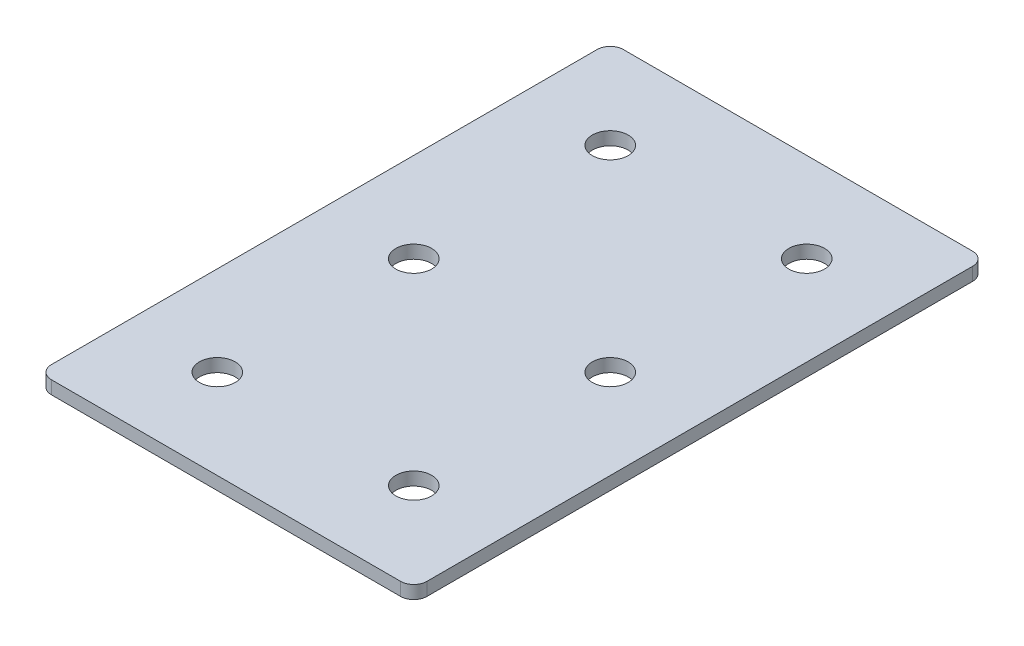
ISO-10303-21;
HEADER;
FILE_DESCRIPTION(('STEP AP214'),'2;1');
FILE_NAME('part.step','',(''),(''),'','','');
FILE_SCHEMA(('AUTOMOTIVE_DESIGN { 1 0 10303 214 1 1 1 1 }'));
ENDSEC;
DATA;
#1=APPLICATION_CONTEXT('core data for automotive mechanical design processes');
#2=APPLICATION_PROTOCOL_DEFINITION('international standard','automotive_design',2000,#1);
#3=PRODUCT_CONTEXT('',#1,'mechanical');
#4=PRODUCT('Part','Part','',(#3));
#5=PRODUCT_RELATED_PRODUCT_CATEGORY('part','',(#4));
#6=PRODUCT_DEFINITION_FORMATION('','',#4);
#7=PRODUCT_DEFINITION_CONTEXT('part definition',#1,'design');
#8=PRODUCT_DEFINITION('design','',#6,#7);
#9=PRODUCT_DEFINITION_SHAPE('','',#8);
#10=(LENGTH_UNIT() NAMED_UNIT(*) SI_UNIT(.MILLI.,.METRE.));
#11=(NAMED_UNIT(*) PLANE_ANGLE_UNIT() SI_UNIT($,.RADIAN.));
#12=(NAMED_UNIT(*) SI_UNIT($,.STERADIAN.) SOLID_ANGLE_UNIT());
#13=UNCERTAINTY_MEASURE_WITH_UNIT(LENGTH_MEASURE(1.E-05),#10,'distance_accuracy_value','');
#14=(GEOMETRIC_REPRESENTATION_CONTEXT(3) GLOBAL_UNCERTAINTY_ASSIGNED_CONTEXT((#13)) GLOBAL_UNIT_ASSIGNED_CONTEXT((#10,
#11,#12)) REPRESENTATION_CONTEXT('',''));
#15=CARTESIAN_POINT('',(0.,0.,0.));
#16=DIRECTION('',(0.,0.,1.));
#17=DIRECTION('',(1.,0.,0.));
#18=AXIS2_PLACEMENT_3D('',#15,#16,#17);
#19=CARTESIAN_POINT('',(-1.74941930794148,1.42462627726309,-46.174731674098));
#20=DIRECTION('',(0.,-1.,0.));
#21=DIRECTION('',(0.,0.,-1.));
#22=AXIS2_PLACEMENT_3D('',#19,#20,#21);
#23=PLANE('',#22);
#24=CARTESIAN_POINT('',(20.7505806920585,1.42462627726309,43.825268325902));
#25=DIRECTION('',(0.,1.,0.));
#26=DIRECTION('',(0.,0.,1.));
#27=AXIS2_PLACEMENT_3D('',#24,#25,#26);
#28=CIRCLE('',#27,4.1);
#29=CARTESIAN_POINT('',(20.7505806920585,1.42462627726309,47.925268325902));
#30=VERTEX_POINT('',#29);
#31=EDGE_CURVE('E177',#30,#30,#28,.T.);
#32=ORIENTED_EDGE('',*,*,#31,.T.);
#33=EDGE_LOOP('',(#32));
#34=FACE_BOUND('',#33,.T.);
#35=CARTESIAN_POINT('',(-24.2494193079415,1.42462627726309,43.825268325902));
#36=DIRECTION('',(0.,1.,0.));
#37=DIRECTION('',(0.,0.,1.));
#38=AXIS2_PLACEMENT_3D('',#35,#36,#37);
#39=CIRCLE('',#38,4.1);
#40=CARTESIAN_POINT('',(-24.2494193079415,1.42462627726309,47.925268325902));
#41=VERTEX_POINT('',#40);
#42=EDGE_CURVE('E171',#41,#41,#39,.T.);
#43=ORIENTED_EDGE('',*,*,#42,.T.);
#44=EDGE_LOOP('',(#43));
#45=FACE_BOUND('',#44,.T.);
#46=CARTESIAN_POINT('',(20.7505806920585,1.42462627726309,-1.17473167409795));
#47=DIRECTION('',(0.,1.,0.));
#48=DIRECTION('',(0.,0.,1.));
#49=AXIS2_PLACEMENT_3D('',#46,#47,#48);
#50=CIRCLE('',#49,4.1);
#51=CARTESIAN_POINT('',(20.7505806920585,1.42462627726309,2.92526832590205));
#52=VERTEX_POINT('',#51);
#53=EDGE_CURVE('E165',#52,#52,#50,.T.);
#54=ORIENTED_EDGE('',*,*,#53,.T.);
#55=EDGE_LOOP('',(#54));
#56=FACE_BOUND('',#55,.T.);
#57=CARTESIAN_POINT('',(-24.2494193079415,1.42462627726309,-1.17473167409795));
#58=DIRECTION('',(0.,1.,0.));
#59=DIRECTION('',(0.,0.,1.));
#60=AXIS2_PLACEMENT_3D('',#57,#58,#59);
#61=CIRCLE('',#60,4.1);
#62=CARTESIAN_POINT('',(-24.2494193079415,1.42462627726309,2.92526832590205));
#63=VERTEX_POINT('',#62);
#64=EDGE_CURVE('E159',#63,#63,#61,.T.);
#65=ORIENTED_EDGE('',*,*,#64,.T.);
#66=EDGE_LOOP('',(#65));
#67=FACE_BOUND('',#66,.T.);
#68=CARTESIAN_POINT('',(20.7505806920585,1.42462627726309,-46.174731674098));
#69=DIRECTION('',(0.,1.,0.));
#70=DIRECTION('',(0.,0.,1.));
#71=AXIS2_PLACEMENT_3D('',#68,#69,#70);
#72=CIRCLE('',#71,4.1);
#73=CARTESIAN_POINT('',(20.7505806920585,1.42462627726309,-42.074731674098));
#74=VERTEX_POINT('',#73);
#75=EDGE_CURVE('E154',#74,#74,#72,.T.);
#76=ORIENTED_EDGE('',*,*,#75,.T.);
#77=EDGE_LOOP('',(#76));
#78=FACE_BOUND('',#77,.T.);
#79=CARTESIAN_POINT('',(-24.2494193079415,1.42462627726309,-46.174731674098));
#80=DIRECTION('',(0.,1.,0.));
#81=DIRECTION('',(0.,0.,1.));
#82=AXIS2_PLACEMENT_3D('',#79,#80,#81);
#83=CIRCLE('',#82,4.1);
#84=CARTESIAN_POINT('',(-24.2494193079415,1.42462627726309,-42.074731674098));
#85=VERTEX_POINT('',#84);
#86=EDGE_CURVE('E147',#85,#85,#83,.T.);
#87=ORIENTED_EDGE('',*,*,#86,.T.);
#88=EDGE_LOOP('',(#87));
#89=FACE_BOUND('',#88,.T.);
#90=DIRECTION('',(0.,0.,-1.));
#91=VECTOR('',#90,1.);
#92=CARTESIAN_POINT('',(41.2505806920586,1.42462627726309,64.325268325902));
#93=LINE('',#92,#91);
#94=CARTESIAN_POINT('',(41.2505806920586,1.42462627726309,61.325268325902));
#95=VERTEX_POINT('',#94);
#96=CARTESIAN_POINT('',(41.2505806920586,1.42462627726309,-63.674731674098));
#97=VERTEX_POINT('',#96);
#98=EDGE_CURVE('E106',#95,#97,#93,.T.);
#99=ORIENTED_EDGE('',*,*,#98,.F.);
#100=CARTESIAN_POINT('',(38.2505806920586,1.42462627726309,61.325268325902));
#101=DIRECTION('',(0.,-1.,0.));
#102=DIRECTION('',(0.,0.,-1.));
#103=AXIS2_PLACEMENT_3D('',#100,#101,#102);
#104=CIRCLE('',#103,3.);
#105=CARTESIAN_POINT('',(38.2505806920586,1.42462627726309,64.325268325902));
#106=VERTEX_POINT('',#105);
#107=EDGE_CURVE('E128',#95,#106,#104,.T.);
#108=ORIENTED_EDGE('',*,*,#107,.T.);
#109=DIRECTION('',(1.,0.,0.));
#110=VECTOR('',#109,1.);
#111=CARTESIAN_POINT('',(-44.7494193079416,1.42462627726309,64.325268325902));
#112=LINE('',#111,#110);
#113=CARTESIAN_POINT('',(-41.7494193079416,1.42462627726309,64.325268325902));
#114=VERTEX_POINT('',#113);
#115=EDGE_CURVE('E110',#114,#106,#112,.T.);
#116=ORIENTED_EDGE('',*,*,#115,.F.);
#117=CARTESIAN_POINT('',(-41.7494193079416,1.42462627726309,61.325268325902));
#118=DIRECTION('',(0.,-1.,0.));
#119=DIRECTION('',(0.,0.,-1.));
#120=AXIS2_PLACEMENT_3D('',#117,#118,#119);
#121=CIRCLE('',#120,3.);
#122=CARTESIAN_POINT('',(-44.7494193079416,1.42462627726309,61.325268325902));
#123=VERTEX_POINT('',#122);
#124=EDGE_CURVE('E105',#114,#123,#121,.T.);
#125=ORIENTED_EDGE('',*,*,#124,.T.);
#126=DIRECTION('',(0.,0.,1.));
#127=VECTOR('',#126,1.);
#128=CARTESIAN_POINT('',(-44.7494193079416,1.42462627726309,-66.674731674098));
#129=LINE('',#128,#127);
#130=CARTESIAN_POINT('',(-44.7494193079416,1.42462627726309,-63.674731674098));
#131=VERTEX_POINT('',#130);
#132=EDGE_CURVE('E137',#131,#123,#129,.T.);
#133=ORIENTED_EDGE('',*,*,#132,.F.);
#134=CARTESIAN_POINT('',(-41.7494193079416,1.42462627726309,-63.674731674098));
#135=DIRECTION('',(0.,-1.,0.));
#136=DIRECTION('',(0.,0.,-1.));
#137=AXIS2_PLACEMENT_3D('',#134,#135,#136);
#138=CIRCLE('',#137,3.);
#139=CARTESIAN_POINT('',(-41.7494193079416,1.42462627726309,-66.674731674098));
#140=VERTEX_POINT('',#139);
#141=EDGE_CURVE('E31',#131,#140,#138,.T.);
#142=ORIENTED_EDGE('',*,*,#141,.T.);
#143=DIRECTION('',(-1.,0.,0.));
#144=VECTOR('',#143,1.);
#145=CARTESIAN_POINT('',(41.2505806920586,1.42462627726309,-66.674731674098));
#146=LINE('',#145,#144);
#147=CARTESIAN_POINT('',(38.2505806920586,1.42462627726309,-66.674731674098));
#148=VERTEX_POINT('',#147);
#149=EDGE_CURVE('E138',#148,#140,#146,.T.);
#150=ORIENTED_EDGE('',*,*,#149,.F.);
#151=CARTESIAN_POINT('',(38.2505806920586,1.42462627726309,-63.674731674098));
#152=DIRECTION('',(0.,-1.,0.));
#153=DIRECTION('',(0.,0.,-1.));
#154=AXIS2_PLACEMENT_3D('',#151,#152,#153);
#155=CIRCLE('',#154,3.);
#156=EDGE_CURVE('E126',#148,#97,#155,.T.);
#157=ORIENTED_EDGE('',*,*,#156,.T.);
#158=EDGE_LOOP('',(#99,#108,#116,#125,#133,#142,#150,#157));
#159=FACE_BOUND('',#158,.T.);
#160=ADVANCED_FACE('F16',(#34,#45,#56,#67,#78,#89,#159),#23,.T.);
#161=CARTESIAN_POINT('',(41.2505806920586,1.42462627726309,-66.674731674098));
#162=DIRECTION('',(0.,0.,-1.));
#163=DIRECTION('',(-1.,0.,0.));
#164=AXIS2_PLACEMENT_3D('',#161,#162,#163);
#165=PLANE('',#164);
#166=DIRECTION('',(-1.,0.,0.));
#167=VECTOR('',#166,1.);
#168=CARTESIAN_POINT('',(41.2505806920586,4.42462627726309,-66.674731674098));
#169=LINE('',#168,#167);
#170=CARTESIAN_POINT('',(38.2505806920586,4.42462627726309,-66.674731674098));
#171=VERTEX_POINT('',#170);
#172=CARTESIAN_POINT('',(-41.7494193079416,4.42462627726309,-66.674731674098));
#173=VERTEX_POINT('',#172);
#174=EDGE_CURVE('E144',#171,#173,#169,.T.);
#175=ORIENTED_EDGE('',*,*,#174,.F.);
#176=DIRECTION('',(0.,1.,0.));
#177=VECTOR('',#176,1.);
#178=CARTESIAN_POINT('',(38.2505806920586,1.42462627726309,-66.674731674098));
#179=LINE('',#178,#177);
#180=EDGE_CURVE('E38',#171,#148,#179,.F.);
#181=ORIENTED_EDGE('',*,*,#180,.T.);
#182=ORIENTED_EDGE('',*,*,#149,.T.);
#183=DIRECTION('',(0.,1.,0.));
#184=VECTOR('',#183,1.);
#185=CARTESIAN_POINT('',(-41.7494193079416,1.42462627726309,-66.674731674098));
#186=LINE('',#185,#184);
#187=EDGE_CURVE('E130',#140,#173,#186,.T.);
#188=ORIENTED_EDGE('',*,*,#187,.T.);
#189=EDGE_LOOP('',(#175,#181,#182,#188));
#190=FACE_BOUND('',#189,.T.);
#191=ADVANCED_FACE('F223',(#190),#165,.T.);
#192=CARTESIAN_POINT('',(41.2505806920586,1.42462627726309,64.325268325902));
#193=DIRECTION('',(1.,0.,0.));
#194=DIRECTION('',(0.,0.,-1.));
#195=AXIS2_PLACEMENT_3D('',#192,#193,#194);
#196=PLANE('',#195);
#197=DIRECTION('',(0.,0.,-1.));
#198=VECTOR('',#197,1.);
#199=CARTESIAN_POINT('',(41.2505806920586,4.42462627726309,64.325268325902));
#200=LINE('',#199,#198);
#201=CARTESIAN_POINT('',(41.2505806920586,4.42462627726309,61.325268325902));
#202=VERTEX_POINT('',#201);
#203=CARTESIAN_POINT('',(41.2505806920586,4.42462627726309,-63.674731674098));
#204=VERTEX_POINT('',#203);
#205=EDGE_CURVE('E102',#202,#204,#200,.T.);
#206=ORIENTED_EDGE('',*,*,#205,.F.);
#207=DIRECTION('',(0.,1.,0.));
#208=VECTOR('',#207,1.);
#209=CARTESIAN_POINT('',(41.2505806920586,1.42462627726309,61.325268325902));
#210=LINE('',#209,#208);
#211=EDGE_CURVE('E122',#202,#95,#210,.F.);
#212=ORIENTED_EDGE('',*,*,#211,.T.);
#213=ORIENTED_EDGE('',*,*,#98,.T.);
#214=DIRECTION('',(0.,1.,0.));
#215=VECTOR('',#214,1.);
#216=CARTESIAN_POINT('',(41.2505806920586,1.42462627726309,-63.674731674098));
#217=LINE('',#216,#215);
#218=EDGE_CURVE('E119',#97,#204,#217,.T.);
#219=ORIENTED_EDGE('',*,*,#218,.T.);
#220=EDGE_LOOP('',(#206,#212,#213,#219));
#221=FACE_BOUND('',#220,.T.);
#222=ADVANCED_FACE('F228',(#221),#196,.T.);
#223=CARTESIAN_POINT('',(-44.7494193079416,1.42462627726309,64.325268325902));
#224=DIRECTION('',(0.,0.,1.));
#225=DIRECTION('',(1.,0.,0.));
#226=AXIS2_PLACEMENT_3D('',#223,#224,#225);
#227=PLANE('',#226);
#228=ORIENTED_EDGE('',*,*,#115,.T.);
#229=DIRECTION('',(0.,1.,0.));
#230=VECTOR('',#229,1.);
#231=CARTESIAN_POINT('',(38.2505806920586,1.42462627726309,64.325268325902));
#232=LINE('',#231,#230);
#233=CARTESIAN_POINT('',(38.2505806920586,4.42462627726309,64.325268325902));
#234=VERTEX_POINT('',#233);
#235=EDGE_CURVE('E93',#106,#234,#232,.T.);
#236=ORIENTED_EDGE('',*,*,#235,.T.);
#237=DIRECTION('',(1.,0.,0.));
#238=VECTOR('',#237,1.);
#239=CARTESIAN_POINT('',(-44.7494193079416,4.42462627726309,64.325268325902));
#240=LINE('',#239,#238);
#241=CARTESIAN_POINT('',(-41.7494193079416,4.42462627726309,64.325268325902));
#242=VERTEX_POINT('',#241);
#243=EDGE_CURVE('E85',#242,#234,#240,.T.);
#244=ORIENTED_EDGE('',*,*,#243,.F.);
#245=DIRECTION('',(0.,1.,0.));
#246=VECTOR('',#245,1.);
#247=CARTESIAN_POINT('',(-41.7494193079416,1.42462627726309,64.325268325902));
#248=LINE('',#247,#246);
#249=EDGE_CURVE('E99',#242,#114,#248,.F.);
#250=ORIENTED_EDGE('',*,*,#249,.T.);
#251=EDGE_LOOP('',(#228,#236,#244,#250));
#252=FACE_BOUND('',#251,.T.);
#253=ADVANCED_FACE('F98',(#252),#227,.T.);
#254=CARTESIAN_POINT('',(-44.7494193079416,1.42462627726309,-66.674731674098));
#255=DIRECTION('',(-1.,0.,0.));
#256=DIRECTION('',(0.,0.,1.));
#257=AXIS2_PLACEMENT_3D('',#254,#255,#256);
#258=PLANE('',#257);
#259=DIRECTION('',(0.,0.,1.));
#260=VECTOR('',#259,1.);
#261=CARTESIAN_POINT('',(-44.7494193079416,4.42462627726309,-66.674731674098));
#262=LINE('',#261,#260);
#263=CARTESIAN_POINT('',(-44.7494193079416,4.42462627726309,-63.674731674098));
#264=VERTEX_POINT('',#263);
#265=CARTESIAN_POINT('',(-44.7494193079416,4.42462627726309,61.325268325902));
#266=VERTEX_POINT('',#265);
#267=EDGE_CURVE('E87',#264,#266,#262,.T.);
#268=ORIENTED_EDGE('',*,*,#267,.F.);
#269=DIRECTION('',(0.,1.,0.));
#270=VECTOR('',#269,1.);
#271=CARTESIAN_POINT('',(-44.7494193079416,1.42462627726309,-63.674731674098));
#272=LINE('',#271,#270);
#273=EDGE_CURVE('E10',#264,#131,#272,.F.);
#274=ORIENTED_EDGE('',*,*,#273,.T.);
#275=ORIENTED_EDGE('',*,*,#132,.T.);
#276=DIRECTION('',(0.,1.,0.));
#277=VECTOR('',#276,1.);
#278=CARTESIAN_POINT('',(-44.7494193079416,1.42462627726309,61.325268325902));
#279=LINE('',#278,#277);
#280=EDGE_CURVE('E24',#123,#266,#279,.T.);
#281=ORIENTED_EDGE('',*,*,#280,.T.);
#282=EDGE_LOOP('',(#268,#274,#275,#281));
#283=FACE_BOUND('',#282,.T.);
#284=ADVANCED_FACE('F135',(#283),#258,.T.);
#285=CARTESIAN_POINT('',(-1.74941930794148,4.42462627726309,-46.174731674098));
#286=DIRECTION('',(0.,-1.,0.));
#287=DIRECTION('',(0.,0.,-1.));
#288=AXIS2_PLACEMENT_3D('',#285,#286,#287);
#289=PLANE('',#288);
#290=CARTESIAN_POINT('',(20.7505806920585,4.42462627726309,43.825268325902));
#291=DIRECTION('',(0.,1.,0.));
#292=DIRECTION('',(0.,0.,1.));
#293=AXIS2_PLACEMENT_3D('',#290,#291,#292);
#294=CIRCLE('',#293,4.1);
#295=CARTESIAN_POINT('',(20.7505806920585,4.42462627726309,47.925268325902));
#296=VERTEX_POINT('',#295);
#297=EDGE_CURVE('E180',#296,#296,#294,.T.);
#298=ORIENTED_EDGE('',*,*,#297,.F.);
#299=EDGE_LOOP('',(#298));
#300=FACE_BOUND('',#299,.T.);
#301=CARTESIAN_POINT('',(-24.2494193079415,4.42462627726309,43.825268325902));
#302=DIRECTION('',(0.,1.,0.));
#303=DIRECTION('',(0.,0.,1.));
#304=AXIS2_PLACEMENT_3D('',#301,#302,#303);
#305=CIRCLE('',#304,4.1);
#306=CARTESIAN_POINT('',(-24.2494193079415,4.42462627726309,47.925268325902));
#307=VERTEX_POINT('',#306);
#308=EDGE_CURVE('E174',#307,#307,#305,.T.);
#309=ORIENTED_EDGE('',*,*,#308,.F.);
#310=EDGE_LOOP('',(#309));
#311=FACE_BOUND('',#310,.T.);
#312=CARTESIAN_POINT('',(20.7505806920585,4.42462627726309,-1.17473167409795));
#313=DIRECTION('',(0.,1.,0.));
#314=DIRECTION('',(0.,0.,1.));
#315=AXIS2_PLACEMENT_3D('',#312,#313,#314);
#316=CIRCLE('',#315,4.1);
#317=CARTESIAN_POINT('',(20.7505806920585,4.42462627726309,2.92526832590205));
#318=VERTEX_POINT('',#317);
#319=EDGE_CURVE('E168',#318,#318,#316,.T.);
#320=ORIENTED_EDGE('',*,*,#319,.F.);
#321=EDGE_LOOP('',(#320));
#322=FACE_BOUND('',#321,.T.);
#323=CARTESIAN_POINT('',(-24.2494193079415,4.42462627726309,-1.17473167409795));
#324=DIRECTION('',(0.,1.,0.));
#325=DIRECTION('',(0.,0.,1.));
#326=AXIS2_PLACEMENT_3D('',#323,#324,#325);
#327=CIRCLE('',#326,4.1);
#328=CARTESIAN_POINT('',(-24.2494193079415,4.42462627726309,2.92526832590205));
#329=VERTEX_POINT('',#328);
#330=EDGE_CURVE('E162',#329,#329,#327,.T.);
#331=ORIENTED_EDGE('',*,*,#330,.F.);
#332=EDGE_LOOP('',(#331));
#333=FACE_BOUND('',#332,.T.);
#334=CARTESIAN_POINT('',(20.7505806920585,4.42462627726309,-46.174731674098));
#335=DIRECTION('',(0.,1.,0.));
#336=DIRECTION('',(0.,0.,1.));
#337=AXIS2_PLACEMENT_3D('',#334,#335,#336);
#338=CIRCLE('',#337,4.1);
#339=CARTESIAN_POINT('',(20.7505806920585,4.42462627726309,-42.074731674098));
#340=VERTEX_POINT('',#339);
#341=EDGE_CURVE('E156',#340,#340,#338,.T.);
#342=ORIENTED_EDGE('',*,*,#341,.F.);
#343=EDGE_LOOP('',(#342));
#344=FACE_BOUND('',#343,.T.);
#345=CARTESIAN_POINT('',(-24.2494193079415,4.42462627726309,-46.174731674098));
#346=DIRECTION('',(0.,1.,0.));
#347=DIRECTION('',(0.,0.,1.));
#348=AXIS2_PLACEMENT_3D('',#345,#346,#347);
#349=CIRCLE('',#348,4.1);
#350=CARTESIAN_POINT('',(-24.2494193079415,4.42462627726309,-42.074731674098));
#351=VERTEX_POINT('',#350);
#352=EDGE_CURVE('E149',#351,#351,#349,.T.);
#353=ORIENTED_EDGE('',*,*,#352,.F.);
#354=EDGE_LOOP('',(#353));
#355=FACE_BOUND('',#354,.T.);
#356=ORIENTED_EDGE('',*,*,#243,.T.);
#357=CARTESIAN_POINT('',(38.2505806920586,4.42462627726309,61.325268325902));
#358=DIRECTION('',(0.,-1.,0.));
#359=DIRECTION('',(0.,0.,-1.));
#360=AXIS2_PLACEMENT_3D('',#357,#358,#359);
#361=CIRCLE('',#360,3.);
#362=EDGE_CURVE('E117',#234,#202,#361,.F.);
#363=ORIENTED_EDGE('',*,*,#362,.T.);
#364=ORIENTED_EDGE('',*,*,#205,.T.);
#365=CARTESIAN_POINT('',(38.2505806920586,4.42462627726309,-63.674731674098));
#366=DIRECTION('',(0.,-1.,0.));
#367=DIRECTION('',(0.,0.,-1.));
#368=AXIS2_PLACEMENT_3D('',#365,#366,#367);
#369=CIRCLE('',#368,3.);
#370=EDGE_CURVE('E115',#204,#171,#369,.F.);
#371=ORIENTED_EDGE('',*,*,#370,.T.);
#372=ORIENTED_EDGE('',*,*,#174,.T.);
#373=CARTESIAN_POINT('',(-41.7494193079416,4.42462627726309,-63.674731674098));
#374=DIRECTION('',(0.,-1.,0.));
#375=DIRECTION('',(0.,0.,-1.));
#376=AXIS2_PLACEMENT_3D('',#373,#374,#375);
#377=CIRCLE('',#376,3.);
#378=EDGE_CURVE('E92',#173,#264,#377,.F.);
#379=ORIENTED_EDGE('',*,*,#378,.T.);
#380=ORIENTED_EDGE('',*,*,#267,.T.);
#381=CARTESIAN_POINT('',(-41.7494193079416,4.42462627726309,61.325268325902));
#382=DIRECTION('',(0.,-1.,0.));
#383=DIRECTION('',(0.,0.,-1.));
#384=AXIS2_PLACEMENT_3D('',#381,#382,#383);
#385=CIRCLE('',#384,3.);
#386=EDGE_CURVE('E82',#266,#242,#385,.F.);
#387=ORIENTED_EDGE('',*,*,#386,.T.);
#388=EDGE_LOOP('',(#356,#363,#364,#371,#372,#379,#380,#387));
#389=FACE_BOUND('',#388,.T.);
#390=ADVANCED_FACE('F84',(#300,#311,#322,#333,#344,#355,#389),#289,.F.);
#391=CARTESIAN_POINT('',(-24.2494193079415,1.42462627726309,-46.174731674098));
#392=DIRECTION('',(0.,1.,0.));
#393=DIRECTION('',(0.,0.,1.));
#394=AXIS2_PLACEMENT_3D('',#391,#392,#393);
#395=CYLINDRICAL_SURFACE('',#394,4.1);
#396=ORIENTED_EDGE('',*,*,#86,.F.);
#397=EDGE_LOOP('',(#396));
#398=FACE_BOUND('',#397,.T.);
#399=ORIENTED_EDGE('',*,*,#352,.T.);
#400=EDGE_LOOP('',(#399));
#401=FACE_BOUND('',#400,.T.);
#402=ADVANCED_FACE('F198',(#398,#401),#395,.F.);
#403=CARTESIAN_POINT('',(20.7505806920585,1.42462627726309,-46.174731674098));
#404=DIRECTION('',(0.,1.,0.));
#405=DIRECTION('',(0.,0.,1.));
#406=AXIS2_PLACEMENT_3D('',#403,#404,#405);
#407=CYLINDRICAL_SURFACE('',#406,4.1);
#408=ORIENTED_EDGE('',*,*,#75,.F.);
#409=EDGE_LOOP('',(#408));
#410=FACE_BOUND('',#409,.T.);
#411=ORIENTED_EDGE('',*,*,#341,.T.);
#412=EDGE_LOOP('',(#411));
#413=FACE_BOUND('',#412,.T.);
#414=ADVANCED_FACE('F211',(#410,#413),#407,.F.);
#415=CARTESIAN_POINT('',(-24.2494193079415,1.42462627726309,-1.17473167409795));
#416=DIRECTION('',(0.,1.,0.));
#417=DIRECTION('',(0.,0.,1.));
#418=AXIS2_PLACEMENT_3D('',#415,#416,#417);
#419=CYLINDRICAL_SURFACE('',#418,4.1);
#420=ORIENTED_EDGE('',*,*,#64,.F.);
#421=EDGE_LOOP('',(#420));
#422=FACE_BOUND('',#421,.T.);
#423=ORIENTED_EDGE('',*,*,#330,.T.);
#424=EDGE_LOOP('',(#423));
#425=FACE_BOUND('',#424,.T.);
#426=ADVANCED_FACE('F218',(#422,#425),#419,.F.);
#427=CARTESIAN_POINT('',(20.7505806920585,1.42462627726309,-1.17473167409795));
#428=DIRECTION('',(0.,1.,0.));
#429=DIRECTION('',(0.,0.,1.));
#430=AXIS2_PLACEMENT_3D('',#427,#428,#429);
#431=CYLINDRICAL_SURFACE('',#430,4.1);
#432=ORIENTED_EDGE('',*,*,#53,.F.);
#433=EDGE_LOOP('',(#432));
#434=FACE_BOUND('',#433,.T.);
#435=ORIENTED_EDGE('',*,*,#319,.T.);
#436=EDGE_LOOP('',(#435));
#437=FACE_BOUND('',#436,.T.);
#438=ADVANCED_FACE('F291',(#434,#437),#431,.F.);
#439=CARTESIAN_POINT('',(-24.2494193079415,1.42462627726309,43.825268325902));
#440=DIRECTION('',(0.,1.,0.));
#441=DIRECTION('',(0.,0.,1.));
#442=AXIS2_PLACEMENT_3D('',#439,#440,#441);
#443=CYLINDRICAL_SURFACE('',#442,4.1);
#444=ORIENTED_EDGE('',*,*,#42,.F.);
#445=EDGE_LOOP('',(#444));
#446=FACE_BOUND('',#445,.T.);
#447=ORIENTED_EDGE('',*,*,#308,.T.);
#448=EDGE_LOOP('',(#447));
#449=FACE_BOUND('',#448,.T.);
#450=ADVANCED_FACE('F192',(#446,#449),#443,.F.);
#451=CARTESIAN_POINT('',(20.7505806920585,1.42462627726309,43.825268325902));
#452=DIRECTION('',(0.,1.,0.));
#453=DIRECTION('',(0.,0.,1.));
#454=AXIS2_PLACEMENT_3D('',#451,#452,#453);
#455=CYLINDRICAL_SURFACE('',#454,4.1);
#456=ORIENTED_EDGE('',*,*,#31,.F.);
#457=EDGE_LOOP('',(#456));
#458=FACE_BOUND('',#457,.T.);
#459=ORIENTED_EDGE('',*,*,#297,.T.);
#460=EDGE_LOOP('',(#459));
#461=FACE_BOUND('',#460,.T.);
#462=ADVANCED_FACE('F188',(#458,#461),#455,.F.);
#463=CARTESIAN_POINT('',(38.2505806920586,1.42462627726309,61.325268325902));
#464=DIRECTION('',(0.,1.,0.));
#465=DIRECTION('',(0.,0.,1.));
#466=AXIS2_PLACEMENT_3D('',#463,#464,#465);
#467=CYLINDRICAL_SURFACE('',#466,3.);
#468=ORIENTED_EDGE('',*,*,#107,.F.);
#469=ORIENTED_EDGE('',*,*,#211,.F.);
#470=ORIENTED_EDGE('',*,*,#362,.F.);
#471=ORIENTED_EDGE('',*,*,#235,.F.);
#472=EDGE_LOOP('',(#468,#469,#470,#471));
#473=FACE_BOUND('',#472,.T.);
#474=ADVANCED_FACE('F191',(#473),#467,.T.);
#475=CARTESIAN_POINT('',(38.2505806920586,1.42462627726309,-63.674731674098));
#476=DIRECTION('',(0.,1.,0.));
#477=DIRECTION('',(0.,0.,1.));
#478=AXIS2_PLACEMENT_3D('',#475,#476,#477);
#479=CYLINDRICAL_SURFACE('',#478,3.);
#480=ORIENTED_EDGE('',*,*,#156,.F.);
#481=ORIENTED_EDGE('',*,*,#180,.F.);
#482=ORIENTED_EDGE('',*,*,#370,.F.);
#483=ORIENTED_EDGE('',*,*,#218,.F.);
#484=EDGE_LOOP('',(#480,#481,#482,#483));
#485=FACE_BOUND('',#484,.T.);
#486=ADVANCED_FACE('F233',(#485),#479,.T.);
#487=CARTESIAN_POINT('',(-41.7494193079416,1.42462627726309,-63.674731674098));
#488=DIRECTION('',(0.,1.,0.));
#489=DIRECTION('',(0.,0.,1.));
#490=AXIS2_PLACEMENT_3D('',#487,#488,#489);
#491=CYLINDRICAL_SURFACE('',#490,3.);
#492=ORIENTED_EDGE('',*,*,#141,.F.);
#493=ORIENTED_EDGE('',*,*,#273,.F.);
#494=ORIENTED_EDGE('',*,*,#378,.F.);
#495=ORIENTED_EDGE('',*,*,#187,.F.);
#496=EDGE_LOOP('',(#492,#493,#494,#495));
#497=FACE_BOUND('',#496,.T.);
#498=ADVANCED_FACE('F236',(#497),#491,.T.);
#499=CARTESIAN_POINT('',(-41.7494193079416,1.42462627726309,61.325268325902));
#500=DIRECTION('',(0.,1.,0.));
#501=DIRECTION('',(0.,0.,1.));
#502=AXIS2_PLACEMENT_3D('',#499,#500,#501);
#503=CYLINDRICAL_SURFACE('',#502,3.);
#504=ORIENTED_EDGE('',*,*,#124,.F.);
#505=ORIENTED_EDGE('',*,*,#249,.F.);
#506=ORIENTED_EDGE('',*,*,#386,.F.);
#507=ORIENTED_EDGE('',*,*,#280,.F.);
#508=EDGE_LOOP('',(#504,#505,#506,#507));
#509=FACE_BOUND('',#508,.T.);
#510=ADVANCED_FACE('F18',(#509),#503,.T.);
#511=CLOSED_SHELL('',(#160,#191,#222,#253,#284,#390,#402,#414,#426,#438,#450,#462,#474,#486,
#498,#510));
#512=MANIFOLD_SOLID_BREP('B1',#511);
#513=ADVANCED_BREP_SHAPE_REPRESENTATION('',(#18,#512),#14);
#514=SHAPE_DEFINITION_REPRESENTATION(#9,#513);
ENDSEC;
END-ISO-10303-21;
